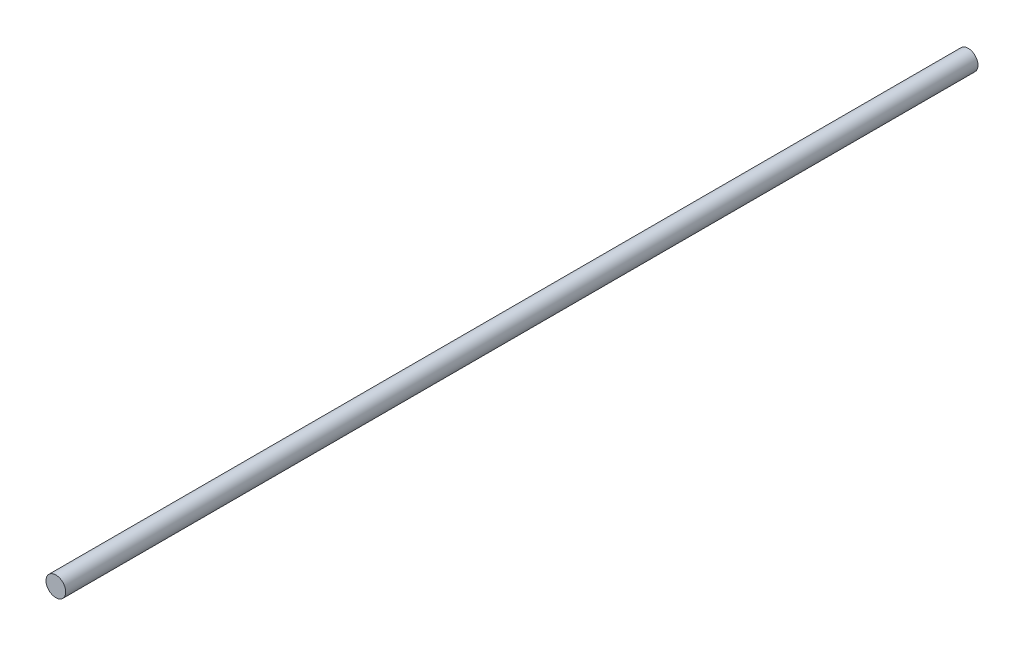
ISO-10303-21;
HEADER;
FILE_DESCRIPTION(('STEP AP214'),'2;1');
FILE_NAME('part.step','',(''),(''),'','','');
FILE_SCHEMA(('AUTOMOTIVE_DESIGN { 1 0 10303 214 1 1 1 1 }'));
ENDSEC;
DATA;
#1=APPLICATION_CONTEXT('core data for automotive mechanical design processes');
#2=APPLICATION_PROTOCOL_DEFINITION('international standard','automotive_design',2000,#1);
#3=PRODUCT_CONTEXT('',#1,'mechanical');
#4=PRODUCT('Part','Part','',(#3));
#5=PRODUCT_RELATED_PRODUCT_CATEGORY('part','',(#4));
#6=PRODUCT_DEFINITION_FORMATION('','',#4);
#7=PRODUCT_DEFINITION_CONTEXT('part definition',#1,'design');
#8=PRODUCT_DEFINITION('design','',#6,#7);
#9=PRODUCT_DEFINITION_SHAPE('','',#8);
#10=(LENGTH_UNIT() NAMED_UNIT(*) SI_UNIT(.MILLI.,.METRE.));
#11=(NAMED_UNIT(*) PLANE_ANGLE_UNIT() SI_UNIT($,.RADIAN.));
#12=(NAMED_UNIT(*) SI_UNIT($,.STERADIAN.) SOLID_ANGLE_UNIT());
#13=UNCERTAINTY_MEASURE_WITH_UNIT(LENGTH_MEASURE(1.E-05),#10,'distance_accuracy_value','');
#14=(GEOMETRIC_REPRESENTATION_CONTEXT(3) GLOBAL_UNCERTAINTY_ASSIGNED_CONTEXT((#13)) GLOBAL_UNIT_ASSIGNED_CONTEXT((#10,
#11,#12)) REPRESENTATION_CONTEXT('',''));
#15=CARTESIAN_POINT('',(0.,0.,0.));
#16=DIRECTION('',(0.,0.,1.));
#17=DIRECTION('',(1.,0.,0.));
#18=AXIS2_PLACEMENT_3D('',#15,#16,#17);
#19=CARTESIAN_POINT('',(0.,0.,370.));
#20=DIRECTION('',(0.,0.,-1.));
#21=DIRECTION('',(-1.,0.,0.));
#22=AXIS2_PLACEMENT_3D('',#19,#20,#21);
#23=CYLINDRICAL_SURFACE('',#22,4.);
#24=CARTESIAN_POINT('',(0.,0.,370.));
#25=DIRECTION('',(0.,0.,1.));
#26=DIRECTION('',(1.,0.,0.));
#27=AXIS2_PLACEMENT_3D('',#24,#25,#26);
#28=CIRCLE('',#27,4.);
#29=CARTESIAN_POINT('',(4.,0.,370.));
#30=VERTEX_POINT('',#29);
#31=EDGE_CURVE('E10',#30,#30,#28,.T.);
#32=ORIENTED_EDGE('',*,*,#31,.F.);
#33=EDGE_LOOP('',(#32));
#34=FACE_BOUND('',#33,.T.);
#35=CARTESIAN_POINT('',(0.,0.,0.));
#36=DIRECTION('',(0.,0.,1.));
#37=DIRECTION('',(1.,0.,0.));
#38=AXIS2_PLACEMENT_3D('',#35,#36,#37);
#39=CIRCLE('',#38,4.);
#40=CARTESIAN_POINT('',(4.,0.,0.));
#41=VERTEX_POINT('',#40);
#42=EDGE_CURVE('E41',#41,#41,#39,.T.);
#43=ORIENTED_EDGE('',*,*,#42,.T.);
#44=EDGE_LOOP('',(#43));
#45=FACE_BOUND('',#44,.T.);
#46=ADVANCED_FACE('F38',(#34,#45),#23,.T.);
#47=CARTESIAN_POINT('',(0.,0.,370.));
#48=DIRECTION('',(0.,0.,1.));
#49=DIRECTION('',(1.,0.,0.));
#50=AXIS2_PLACEMENT_3D('',#47,#48,#49);
#51=PLANE('',#50);
#52=ORIENTED_EDGE('',*,*,#31,.T.);
#53=EDGE_LOOP('',(#52));
#54=FACE_BOUND('',#53,.T.);
#55=ADVANCED_FACE('F54',(#54),#51,.T.);
#56=CARTESIAN_POINT('',(0.,0.,0.));
#57=DIRECTION('',(0.,0.,1.));
#58=DIRECTION('',(1.,0.,0.));
#59=AXIS2_PLACEMENT_3D('',#56,#57,#58);
#60=PLANE('',#59);
#61=ORIENTED_EDGE('',*,*,#42,.F.);
#62=EDGE_LOOP('',(#61));
#63=FACE_BOUND('',#62,.T.);
#64=ADVANCED_FACE('F52',(#63),#60,.F.);
#65=CLOSED_SHELL('',(#46,#55,#64));
#66=MANIFOLD_SOLID_BREP('B2',#65);
#67=ADVANCED_BREP_SHAPE_REPRESENTATION('',(#18,#66),#14);
#68=SHAPE_DEFINITION_REPRESENTATION(#9,#67);
ENDSEC;
END-ISO-10303-21;
